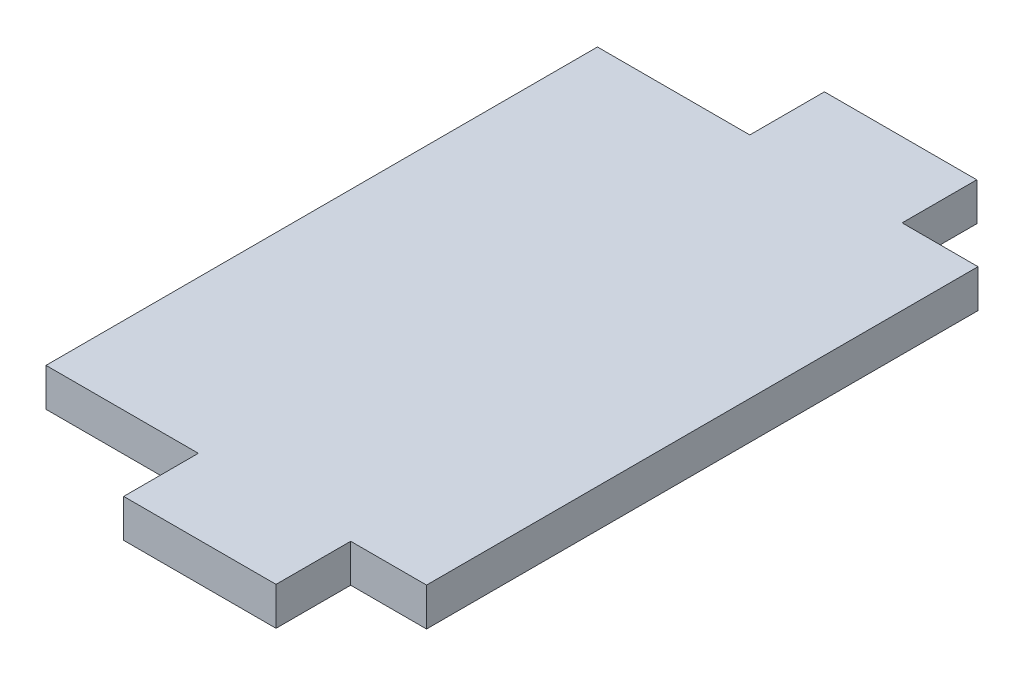
ISO-10303-21;
HEADER;
FILE_DESCRIPTION(('STEP AP214'),'2;1');
FILE_NAME('part.step','',(''),(''),'','','');
FILE_SCHEMA(('AUTOMOTIVE_DESIGN { 1 0 10303 214 1 1 1 1 }'));
ENDSEC;
DATA;
#1=APPLICATION_CONTEXT('core data for automotive mechanical design processes');
#2=APPLICATION_PROTOCOL_DEFINITION('international standard','automotive_design',2000,#1);
#3=PRODUCT_CONTEXT('',#1,'mechanical');
#4=PRODUCT('Part','Part','',(#3));
#5=PRODUCT_RELATED_PRODUCT_CATEGORY('part','',(#4));
#6=PRODUCT_DEFINITION_FORMATION('','',#4);
#7=PRODUCT_DEFINITION_CONTEXT('part definition',#1,'design');
#8=PRODUCT_DEFINITION('design','',#6,#7);
#9=PRODUCT_DEFINITION_SHAPE('','',#8);
#10=(LENGTH_UNIT() NAMED_UNIT(*) SI_UNIT(.MILLI.,.METRE.));
#11=(NAMED_UNIT(*) PLANE_ANGLE_UNIT() SI_UNIT($,.RADIAN.));
#12=(NAMED_UNIT(*) SI_UNIT($,.STERADIAN.) SOLID_ANGLE_UNIT());
#13=UNCERTAINTY_MEASURE_WITH_UNIT(LENGTH_MEASURE(1.E-05),#10,'distance_accuracy_value','');
#14=(GEOMETRIC_REPRESENTATION_CONTEXT(3) GLOBAL_UNCERTAINTY_ASSIGNED_CONTEXT((#13)) GLOBAL_UNIT_ASSIGNED_CONTEXT((#10,
#11,#12)) REPRESENTATION_CONTEXT('',''));
#15=CARTESIAN_POINT('',(0.,0.,0.));
#16=DIRECTION('',(0.,0.,1.));
#17=DIRECTION('',(1.,0.,0.));
#18=AXIS2_PLACEMENT_3D('',#15,#16,#17);
#19=CARTESIAN_POINT('',(0.,3.175,0.));
#20=DIRECTION('',(-1.,0.,0.));
#21=DIRECTION('',(0.,0.,1.));
#22=AXIS2_PLACEMENT_3D('',#19,#20,#21);
#23=PLANE('',#22);
#24=DIRECTION('',(0.,0.,-1.));
#25=VECTOR('',#24,1.);
#26=CARTESIAN_POINT('',(0.,0.,0.));
#27=LINE('',#26,#25);
#28=CARTESIAN_POINT('',(0.,0.,0.));
#29=VERTEX_POINT('',#28);
#30=CARTESIAN_POINT('',(0.,0.,-6.22299999999999));
#31=VERTEX_POINT('',#30);
#32=EDGE_CURVE('E152',#29,#31,#27,.T.);
#33=ORIENTED_EDGE('',*,*,#32,.T.);
#34=DIRECTION('',(0.,-1.,0.));
#35=VECTOR('',#34,1.);
#36=CARTESIAN_POINT('',(0.,3.175,-6.22299999999999));
#37=LINE('',#36,#35);
#38=CARTESIAN_POINT('',(0.,3.175,-6.22299999999999));
#39=VERTEX_POINT('',#38);
#40=EDGE_CURVE('E11',#39,#31,#37,.T.);
#41=ORIENTED_EDGE('',*,*,#40,.F.);
#42=DIRECTION('',(0.,0.,-1.));
#43=VECTOR('',#42,1.);
#44=CARTESIAN_POINT('',(0.,3.175,0.));
#45=LINE('',#44,#43);
#46=CARTESIAN_POINT('',(0.,3.175,0.));
#47=VERTEX_POINT('',#46);
#48=EDGE_CURVE('E174',#47,#39,#45,.T.);
#49=ORIENTED_EDGE('',*,*,#48,.F.);
#50=DIRECTION('',(0.,-1.,0.));
#51=VECTOR('',#50,1.);
#52=CARTESIAN_POINT('',(0.,3.175,0.));
#53=LINE('',#52,#51);
#54=EDGE_CURVE('E148',#47,#29,#53,.T.);
#55=ORIENTED_EDGE('',*,*,#54,.T.);
#56=EDGE_LOOP('',(#33,#41,#49,#55));
#57=FACE_BOUND('',#56,.T.);
#58=ADVANCED_FACE('F32',(#57),#23,.F.);
#59=CARTESIAN_POINT('',(0.,3.175,-6.22299999999999));
#60=DIRECTION('',(0.,0.,-1.));
#61=DIRECTION('',(-1.,0.,0.));
#62=AXIS2_PLACEMENT_3D('',#59,#60,#61);
#63=PLANE('',#62);
#64=DIRECTION('',(1.,0.,0.));
#65=VECTOR('',#64,1.);
#66=CARTESIAN_POINT('',(0.,0.,-6.22299999999999));
#67=LINE('',#66,#65);
#68=CARTESIAN_POINT('',(6.3246,0.,-6.22299999999999));
#69=VERTEX_POINT('',#68);
#70=EDGE_CURVE('E155',#31,#69,#67,.T.);
#71=ORIENTED_EDGE('',*,*,#70,.T.);
#72=DIRECTION('',(0.,-1.,0.));
#73=VECTOR('',#72,1.);
#74=CARTESIAN_POINT('',(6.3246,3.175,-6.22299999999999));
#75=LINE('',#74,#73);
#76=CARTESIAN_POINT('',(6.3246,3.175,-6.22299999999999));
#77=VERTEX_POINT('',#76);
#78=EDGE_CURVE('E40',#77,#69,#75,.T.);
#79=ORIENTED_EDGE('',*,*,#78,.F.);
#80=DIRECTION('',(1.,0.,0.));
#81=VECTOR('',#80,1.);
#82=CARTESIAN_POINT('',(0.,3.175,-6.22299999999999));
#83=LINE('',#82,#81);
#84=EDGE_CURVE('E103',#39,#77,#83,.T.);
#85=ORIENTED_EDGE('',*,*,#84,.F.);
#86=ORIENTED_EDGE('',*,*,#40,.T.);
#87=EDGE_LOOP('',(#71,#79,#85,#86));
#88=FACE_BOUND('',#87,.T.);
#89=ADVANCED_FACE('F252',(#88),#63,.F.);
#90=CARTESIAN_POINT('',(6.32459999999999,3.175,-52.197));
#91=DIRECTION('',(-1.,0.,0.));
#92=DIRECTION('',(0.,0.,1.));
#93=AXIS2_PLACEMENT_3D('',#90,#91,#92);
#94=PLANE('',#93);
#95=DIRECTION('',(0.,0.,-1.));
#96=VECTOR('',#95,1.);
#97=CARTESIAN_POINT('',(6.32459999999999,0.,-52.197));
#98=LINE('',#97,#96);
#99=CARTESIAN_POINT('',(6.32459999999999,0.,-52.197));
#100=VERTEX_POINT('',#99);
#101=EDGE_CURVE('E157',#69,#100,#98,.T.);
#102=ORIENTED_EDGE('',*,*,#101,.T.);
#103=DIRECTION('',(0.,-1.,0.));
#104=VECTOR('',#103,1.);
#105=CARTESIAN_POINT('',(6.32459999999999,3.175,-52.197));
#106=LINE('',#105,#104);
#107=CARTESIAN_POINT('',(6.32459999999999,3.175,-52.197));
#108=VERTEX_POINT('',#107);
#109=EDGE_CURVE('E193',#108,#100,#106,.T.);
#110=ORIENTED_EDGE('',*,*,#109,.F.);
#111=DIRECTION('',(0.,0.,-1.));
#112=VECTOR('',#111,1.);
#113=CARTESIAN_POINT('',(6.32459999999999,3.175,-52.197));
#114=LINE('',#113,#112);
#115=EDGE_CURVE('E201',#77,#108,#114,.T.);
#116=ORIENTED_EDGE('',*,*,#115,.F.);
#117=ORIENTED_EDGE('',*,*,#78,.T.);
#118=EDGE_LOOP('',(#102,#110,#116,#117));
#119=FACE_BOUND('',#118,.T.);
#120=ADVANCED_FACE('F199',(#119),#94,.F.);
#121=CARTESIAN_POINT('',(0.,3.175,-52.197));
#122=DIRECTION('',(0.,0.,1.));
#123=DIRECTION('',(1.,0.,0.));
#124=AXIS2_PLACEMENT_3D('',#121,#122,#123);
#125=PLANE('',#124);
#126=DIRECTION('',(-1.,0.,0.));
#127=VECTOR('',#126,1.);
#128=CARTESIAN_POINT('',(0.,0.,-52.197));
#129=LINE('',#128,#127);
#130=CARTESIAN_POINT('',(0.,0.,-52.197));
#131=VERTEX_POINT('',#130);
#132=EDGE_CURVE('E159',#100,#131,#129,.T.);
#133=ORIENTED_EDGE('',*,*,#132,.T.);
#134=DIRECTION('',(0.,-1.,0.));
#135=VECTOR('',#134,1.);
#136=CARTESIAN_POINT('',(0.,3.175,-52.197));
#137=LINE('',#136,#135);
#138=CARTESIAN_POINT('',(0.,3.175,-52.197));
#139=VERTEX_POINT('',#138);
#140=EDGE_CURVE('E190',#139,#131,#137,.T.);
#141=ORIENTED_EDGE('',*,*,#140,.F.);
#142=DIRECTION('',(-1.,0.,0.));
#143=VECTOR('',#142,1.);
#144=CARTESIAN_POINT('',(0.,3.175,-52.197));
#145=LINE('',#144,#143);
#146=EDGE_CURVE('E219',#108,#139,#145,.T.);
#147=ORIENTED_EDGE('',*,*,#146,.F.);
#148=ORIENTED_EDGE('',*,*,#109,.T.);
#149=EDGE_LOOP('',(#133,#141,#147,#148));
#150=FACE_BOUND('',#149,.T.);
#151=ADVANCED_FACE('F210',(#150),#125,.F.);
#152=CARTESIAN_POINT('',(0.,3.175,-52.197));
#153=DIRECTION('',(-1.,0.,0.));
#154=DIRECTION('',(0.,0.,1.));
#155=AXIS2_PLACEMENT_3D('',#152,#153,#154);
#156=PLANE('',#155);
#157=DIRECTION('',(0.,0.,-1.));
#158=VECTOR('',#157,1.);
#159=CARTESIAN_POINT('',(0.,0.,-52.197));
#160=LINE('',#159,#158);
#161=CARTESIAN_POINT('',(0.,0.,-58.42));
#162=VERTEX_POINT('',#161);
#163=EDGE_CURVE('E161',#131,#162,#160,.T.);
#164=ORIENTED_EDGE('',*,*,#163,.T.);
#165=DIRECTION('',(0.,-1.,0.));
#166=VECTOR('',#165,1.);
#167=CARTESIAN_POINT('',(0.,3.175,-58.42));
#168=LINE('',#167,#166);
#169=CARTESIAN_POINT('',(0.,3.175,-58.42));
#170=VERTEX_POINT('',#169);
#171=EDGE_CURVE('E187',#170,#162,#168,.T.);
#172=ORIENTED_EDGE('',*,*,#171,.F.);
#173=DIRECTION('',(0.,0.,-1.));
#174=VECTOR('',#173,1.);
#175=CARTESIAN_POINT('',(0.,3.175,-52.197));
#176=LINE('',#175,#174);
#177=EDGE_CURVE('E216',#139,#170,#176,.T.);
#178=ORIENTED_EDGE('',*,*,#177,.F.);
#179=ORIENTED_EDGE('',*,*,#140,.T.);
#180=EDGE_LOOP('',(#164,#172,#178,#179));
#181=FACE_BOUND('',#180,.T.);
#182=ADVANCED_FACE('F214',(#181),#156,.F.);
#183=CARTESIAN_POINT('',(0.,3.175,-58.42));
#184=DIRECTION('',(0.,0.,1.));
#185=DIRECTION('',(1.,0.,0.));
#186=AXIS2_PLACEMENT_3D('',#183,#184,#185);
#187=PLANE('',#186);
#188=DIRECTION('',(-1.,0.,0.));
#189=VECTOR('',#188,1.);
#190=CARTESIAN_POINT('',(0.,0.,-58.42));
#191=LINE('',#190,#189);
#192=CARTESIAN_POINT('',(-12.7,0.,-58.42));
#193=VERTEX_POINT('',#192);
#194=EDGE_CURVE('E163',#162,#193,#191,.T.);
#195=ORIENTED_EDGE('',*,*,#194,.T.);
#196=DIRECTION('',(0.,-1.,0.));
#197=VECTOR('',#196,1.);
#198=CARTESIAN_POINT('',(-12.7,3.175,-58.42));
#199=LINE('',#198,#197);
#200=CARTESIAN_POINT('',(-12.7,3.175,-58.42));
#201=VERTEX_POINT('',#200);
#202=EDGE_CURVE('E184',#201,#193,#199,.T.);
#203=ORIENTED_EDGE('',*,*,#202,.F.);
#204=DIRECTION('',(-1.,0.,0.));
#205=VECTOR('',#204,1.);
#206=CARTESIAN_POINT('',(0.,3.175,-58.42));
#207=LINE('',#206,#205);
#208=EDGE_CURVE('E218',#170,#201,#207,.T.);
#209=ORIENTED_EDGE('',*,*,#208,.F.);
#210=ORIENTED_EDGE('',*,*,#171,.T.);
#211=EDGE_LOOP('',(#195,#203,#209,#210));
#212=FACE_BOUND('',#211,.T.);
#213=ADVANCED_FACE('F265',(#212),#187,.F.);
#214=CARTESIAN_POINT('',(-12.7,3.175,-52.197));
#215=DIRECTION('',(1.,0.,0.));
#216=DIRECTION('',(0.,0.,-1.));
#217=AXIS2_PLACEMENT_3D('',#214,#215,#216);
#218=PLANE('',#217);
#219=DIRECTION('',(0.,0.,1.));
#220=VECTOR('',#219,1.);
#221=CARTESIAN_POINT('',(-12.7,0.,-52.197));
#222=LINE('',#221,#220);
#223=CARTESIAN_POINT('',(-12.7,0.,-52.197));
#224=VERTEX_POINT('',#223);
#225=EDGE_CURVE('E165',#193,#224,#222,.T.);
#226=ORIENTED_EDGE('',*,*,#225,.T.);
#227=DIRECTION('',(0.,-1.,0.));
#228=VECTOR('',#227,1.);
#229=CARTESIAN_POINT('',(-12.7,3.175,-52.197));
#230=LINE('',#229,#228);
#231=CARTESIAN_POINT('',(-12.7,3.175,-52.197));
#232=VERTEX_POINT('',#231);
#233=EDGE_CURVE('E181',#232,#224,#230,.T.);
#234=ORIENTED_EDGE('',*,*,#233,.F.);
#235=DIRECTION('',(0.,0.,1.));
#236=VECTOR('',#235,1.);
#237=CARTESIAN_POINT('',(-12.7,3.175,-52.197));
#238=LINE('',#237,#236);
#239=EDGE_CURVE('E221',#201,#232,#238,.T.);
#240=ORIENTED_EDGE('',*,*,#239,.F.);
#241=ORIENTED_EDGE('',*,*,#202,.T.);
#242=EDGE_LOOP('',(#226,#234,#240,#241));
#243=FACE_BOUND('',#242,.T.);
#244=ADVANCED_FACE('F268',(#243),#218,.F.);
#245=CARTESIAN_POINT('',(-12.7,3.175,-52.197));
#246=DIRECTION('',(0.,0.,1.));
#247=DIRECTION('',(1.,0.,0.));
#248=AXIS2_PLACEMENT_3D('',#245,#246,#247);
#249=PLANE('',#248);
#250=DIRECTION('',(-1.,0.,0.));
#251=VECTOR('',#250,1.);
#252=CARTESIAN_POINT('',(-12.7,0.,-52.197));
#253=LINE('',#252,#251);
#254=CARTESIAN_POINT('',(-25.4,0.,-52.197));
#255=VERTEX_POINT('',#254);
#256=EDGE_CURVE('E167',#224,#255,#253,.T.);
#257=ORIENTED_EDGE('',*,*,#256,.T.);
#258=DIRECTION('',(0.,-1.,0.));
#259=VECTOR('',#258,1.);
#260=CARTESIAN_POINT('',(-25.4,3.175,-52.197));
#261=LINE('',#260,#259);
#262=CARTESIAN_POINT('',(-25.4,3.175,-52.197));
#263=VERTEX_POINT('',#262);
#264=EDGE_CURVE('E178',#263,#255,#261,.T.);
#265=ORIENTED_EDGE('',*,*,#264,.F.);
#266=DIRECTION('',(-1.,0.,0.));
#267=VECTOR('',#266,1.);
#268=CARTESIAN_POINT('',(-12.7,3.175,-52.197));
#269=LINE('',#268,#267);
#270=EDGE_CURVE('E227',#232,#263,#269,.T.);
#271=ORIENTED_EDGE('',*,*,#270,.F.);
#272=ORIENTED_EDGE('',*,*,#233,.T.);
#273=EDGE_LOOP('',(#257,#265,#271,#272));
#274=FACE_BOUND('',#273,.T.);
#275=ADVANCED_FACE('F233',(#274),#249,.F.);
#276=CARTESIAN_POINT('',(-25.4,3.175,-6.22299999999999));
#277=DIRECTION('',(1.,0.,0.));
#278=DIRECTION('',(0.,0.,-1.));
#279=AXIS2_PLACEMENT_3D('',#276,#277,#278);
#280=PLANE('',#279);
#281=DIRECTION('',(0.,0.,1.));
#282=VECTOR('',#281,1.);
#283=CARTESIAN_POINT('',(-25.4,0.,-6.22299999999999));
#284=LINE('',#283,#282);
#285=CARTESIAN_POINT('',(-25.4,0.,-6.22299999999999));
#286=VERTEX_POINT('',#285);
#287=EDGE_CURVE('E169',#255,#286,#284,.T.);
#288=ORIENTED_EDGE('',*,*,#287,.T.);
#289=DIRECTION('',(0.,-1.,0.));
#290=VECTOR('',#289,1.);
#291=CARTESIAN_POINT('',(-25.4,3.175,-6.22299999999999));
#292=LINE('',#291,#290);
#293=CARTESIAN_POINT('',(-25.4,3.175,-6.22299999999999));
#294=VERTEX_POINT('',#293);
#295=EDGE_CURVE('E143',#294,#286,#292,.T.);
#296=ORIENTED_EDGE('',*,*,#295,.F.);
#297=DIRECTION('',(0.,0.,1.));
#298=VECTOR('',#297,1.);
#299=CARTESIAN_POINT('',(-25.4,3.175,-6.22299999999999));
#300=LINE('',#299,#298);
#301=EDGE_CURVE('E134',#263,#294,#300,.T.);
#302=ORIENTED_EDGE('',*,*,#301,.F.);
#303=ORIENTED_EDGE('',*,*,#264,.T.);
#304=EDGE_LOOP('',(#288,#296,#302,#303));
#305=FACE_BOUND('',#304,.T.);
#306=ADVANCED_FACE('F237',(#305),#280,.F.);
#307=CARTESIAN_POINT('',(-12.7,3.175,-6.22299999999999));
#308=DIRECTION('',(0.,0.,-1.));
#309=DIRECTION('',(-1.,0.,0.));
#310=AXIS2_PLACEMENT_3D('',#307,#308,#309);
#311=PLANE('',#310);
#312=DIRECTION('',(1.,0.,0.));
#313=VECTOR('',#312,1.);
#314=CARTESIAN_POINT('',(-12.7,0.,-6.22299999999999));
#315=LINE('',#314,#313);
#316=CARTESIAN_POINT('',(-12.7,0.,-6.22299999999999));
#317=VERTEX_POINT('',#316);
#318=EDGE_CURVE('E142',#286,#317,#315,.T.);
#319=ORIENTED_EDGE('',*,*,#318,.T.);
#320=DIRECTION('',(0.,-1.,0.));
#321=VECTOR('',#320,1.);
#322=CARTESIAN_POINT('',(-12.7,3.175,-6.22299999999999));
#323=LINE('',#322,#321);
#324=CARTESIAN_POINT('',(-12.7,3.175,-6.22299999999999));
#325=VERTEX_POINT('',#324);
#326=EDGE_CURVE('E139',#325,#317,#323,.T.);
#327=ORIENTED_EDGE('',*,*,#326,.F.);
#328=DIRECTION('',(1.,0.,0.));
#329=VECTOR('',#328,1.);
#330=CARTESIAN_POINT('',(-12.7,3.175,-6.22299999999999));
#331=LINE('',#330,#329);
#332=EDGE_CURVE('E128',#294,#325,#331,.T.);
#333=ORIENTED_EDGE('',*,*,#332,.F.);
#334=ORIENTED_EDGE('',*,*,#295,.T.);
#335=EDGE_LOOP('',(#319,#327,#333,#334));
#336=FACE_BOUND('',#335,.T.);
#337=ADVANCED_FACE('F140',(#336),#311,.F.);
#338=CARTESIAN_POINT('',(-12.7,3.175,0.));
#339=DIRECTION('',(1.,0.,0.));
#340=DIRECTION('',(0.,0.,-1.));
#341=AXIS2_PLACEMENT_3D('',#338,#339,#340);
#342=PLANE('',#341);
#343=DIRECTION('',(0.,0.,1.));
#344=VECTOR('',#343,1.);
#345=CARTESIAN_POINT('',(-12.7,0.,0.));
#346=LINE('',#345,#344);
#347=CARTESIAN_POINT('',(-12.7,0.,0.));
#348=VERTEX_POINT('',#347);
#349=EDGE_CURVE('E89',#317,#348,#346,.T.);
#350=ORIENTED_EDGE('',*,*,#349,.T.);
#351=DIRECTION('',(0.,-1.,0.));
#352=VECTOR('',#351,1.);
#353=CARTESIAN_POINT('',(-12.7,3.175,0.));
#354=LINE('',#353,#352);
#355=CARTESIAN_POINT('',(-12.7,3.175,0.));
#356=VERTEX_POINT('',#355);
#357=EDGE_CURVE('E144',#356,#348,#354,.T.);
#358=ORIENTED_EDGE('',*,*,#357,.F.);
#359=DIRECTION('',(0.,0.,1.));
#360=VECTOR('',#359,1.);
#361=CARTESIAN_POINT('',(-12.7,3.175,0.));
#362=LINE('',#361,#360);
#363=EDGE_CURVE('E132',#325,#356,#362,.T.);
#364=ORIENTED_EDGE('',*,*,#363,.F.);
#365=ORIENTED_EDGE('',*,*,#326,.T.);
#366=EDGE_LOOP('',(#350,#358,#364,#365));
#367=FACE_BOUND('',#366,.T.);
#368=ADVANCED_FACE('F146',(#367),#342,.F.);
#369=CARTESIAN_POINT('',(0.,3.175,0.));
#370=DIRECTION('',(0.,0.,-1.));
#371=DIRECTION('',(-1.,0.,0.));
#372=AXIS2_PLACEMENT_3D('',#369,#370,#371);
#373=PLANE('',#372);
#374=DIRECTION('',(1.,0.,0.));
#375=VECTOR('',#374,1.);
#376=CARTESIAN_POINT('',(0.,0.,0.));
#377=LINE('',#376,#375);
#378=EDGE_CURVE('E95',#348,#29,#377,.T.);
#379=ORIENTED_EDGE('',*,*,#378,.T.);
#380=ORIENTED_EDGE('',*,*,#54,.F.);
#381=DIRECTION('',(1.,0.,0.));
#382=VECTOR('',#381,1.);
#383=CARTESIAN_POINT('',(0.,3.175,0.));
#384=LINE('',#383,#382);
#385=EDGE_CURVE('E48',#356,#47,#384,.T.);
#386=ORIENTED_EDGE('',*,*,#385,.F.);
#387=ORIENTED_EDGE('',*,*,#357,.T.);
#388=EDGE_LOOP('',(#379,#380,#386,#387));
#389=FACE_BOUND('',#388,.T.);
#390=ADVANCED_FACE('F241',(#389),#373,.F.);
#391=CARTESIAN_POINT('',(0.,3.175,0.));
#392=DIRECTION('',(0.,-1.,0.));
#393=DIRECTION('',(0.,0.,-1.));
#394=AXIS2_PLACEMENT_3D('',#391,#392,#393);
#395=PLANE('',#394);
#396=ORIENTED_EDGE('',*,*,#48,.T.);
#397=ORIENTED_EDGE('',*,*,#84,.T.);
#398=ORIENTED_EDGE('',*,*,#115,.T.);
#399=ORIENTED_EDGE('',*,*,#146,.T.);
#400=ORIENTED_EDGE('',*,*,#177,.T.);
#401=ORIENTED_EDGE('',*,*,#208,.T.);
#402=ORIENTED_EDGE('',*,*,#239,.T.);
#403=ORIENTED_EDGE('',*,*,#270,.T.);
#404=ORIENTED_EDGE('',*,*,#301,.T.);
#405=ORIENTED_EDGE('',*,*,#332,.T.);
#406=ORIENTED_EDGE('',*,*,#363,.T.);
#407=ORIENTED_EDGE('',*,*,#385,.T.);
#408=EDGE_LOOP('',(#396,#397,#398,#399,#400,#401,#402,#403,#404,#405,#406,#407));
#409=FACE_BOUND('',#408,.T.);
#410=ADVANCED_FACE('F130',(#409),#395,.F.);
#411=CARTESIAN_POINT('',(0.,0.,0.));
#412=DIRECTION('',(0.,-1.,0.));
#413=DIRECTION('',(0.,0.,-1.));
#414=AXIS2_PLACEMENT_3D('',#411,#412,#413);
#415=PLANE('',#414);
#416=ORIENTED_EDGE('',*,*,#32,.F.);
#417=ORIENTED_EDGE('',*,*,#378,.F.);
#418=ORIENTED_EDGE('',*,*,#349,.F.);
#419=ORIENTED_EDGE('',*,*,#318,.F.);
#420=ORIENTED_EDGE('',*,*,#287,.F.);
#421=ORIENTED_EDGE('',*,*,#256,.F.);
#422=ORIENTED_EDGE('',*,*,#225,.F.);
#423=ORIENTED_EDGE('',*,*,#194,.F.);
#424=ORIENTED_EDGE('',*,*,#163,.F.);
#425=ORIENTED_EDGE('',*,*,#132,.F.);
#426=ORIENTED_EDGE('',*,*,#101,.F.);
#427=ORIENTED_EDGE('',*,*,#70,.F.);
#428=EDGE_LOOP('',(#416,#417,#418,#419,#420,#421,#422,#423,#424,#425,#426,#427));
#429=FACE_BOUND('',#428,.T.);
#430=ADVANCED_FACE('F205',(#429),#415,.T.);
#431=CLOSED_SHELL('',(#58,#89,#120,#151,#182,#213,#244,#275,#306,#337,#368,#390,#410,#430));
#432=MANIFOLD_SOLID_BREP('B2',#431);
#433=ADVANCED_BREP_SHAPE_REPRESENTATION('',(#18,#432),#14);
#434=SHAPE_DEFINITION_REPRESENTATION(#9,#433);
ENDSEC;
END-ISO-10303-21;
